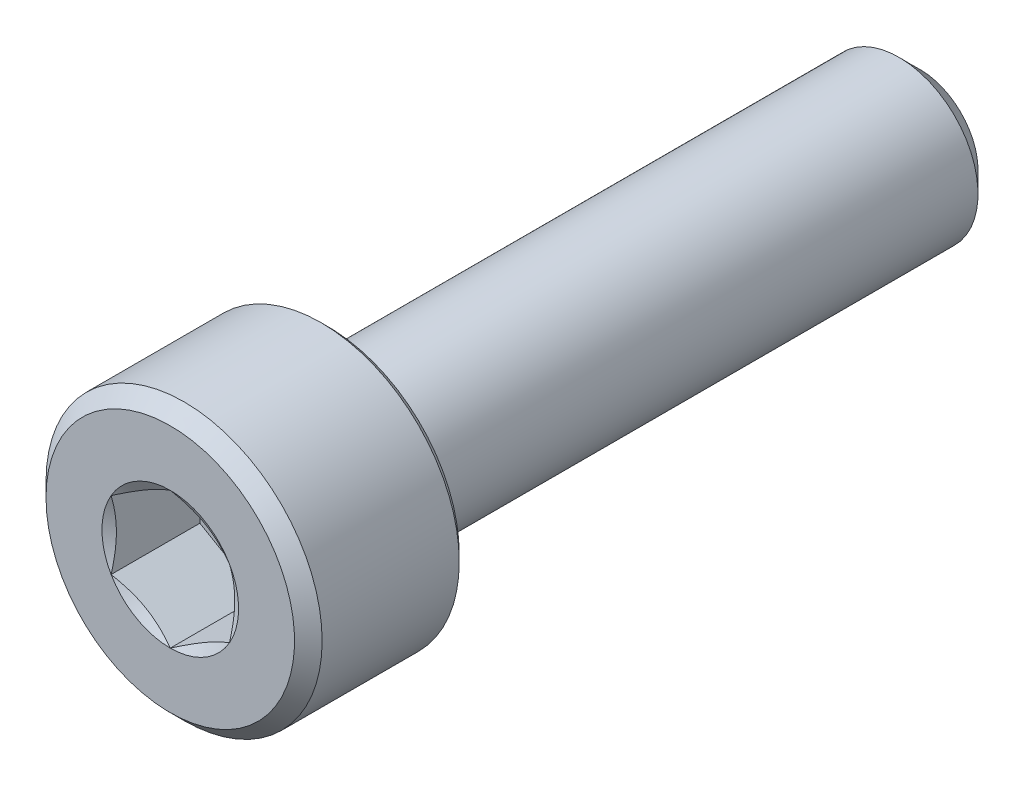
ISO-10303-21;
HEADER;
FILE_DESCRIPTION(('STEP AP214'),'2;1');
FILE_NAME('part.step','',(''),(''),'','','');
FILE_SCHEMA(('AUTOMOTIVE_DESIGN { 1 0 10303 214 1 1 1 1 }'));
ENDSEC;
DATA;
#1=APPLICATION_CONTEXT('core data for automotive mechanical design processes');
#2=APPLICATION_PROTOCOL_DEFINITION('international standard','automotive_design',2000,#1);
#3=PRODUCT_CONTEXT('',#1,'mechanical');
#4=PRODUCT('Part','Part','',(#3));
#5=PRODUCT_RELATED_PRODUCT_CATEGORY('part','',(#4));
#6=PRODUCT_DEFINITION_FORMATION('','',#4);
#7=PRODUCT_DEFINITION_CONTEXT('part definition',#1,'design');
#8=PRODUCT_DEFINITION('design','',#6,#7);
#9=PRODUCT_DEFINITION_SHAPE('','',#8);
#10=(LENGTH_UNIT() NAMED_UNIT(*) SI_UNIT(.MILLI.,.METRE.));
#11=(NAMED_UNIT(*) PLANE_ANGLE_UNIT() SI_UNIT($,.RADIAN.));
#12=(NAMED_UNIT(*) SI_UNIT($,.STERADIAN.) SOLID_ANGLE_UNIT());
#13=UNCERTAINTY_MEASURE_WITH_UNIT(LENGTH_MEASURE(1.E-05),#10,'distance_accuracy_value','');
#14=(GEOMETRIC_REPRESENTATION_CONTEXT(3) GLOBAL_UNCERTAINTY_ASSIGNED_CONTEXT((#13)) GLOBAL_UNIT_ASSIGNED_CONTEXT((#10,
#11,#12)) REPRESENTATION_CONTEXT('',''));
#15=CARTESIAN_POINT('',(0.,0.,0.));
#16=DIRECTION('',(0.,0.,1.));
#17=DIRECTION('',(1.,0.,0.));
#18=AXIS2_PLACEMENT_3D('',#15,#16,#17);
#19=CARTESIAN_POINT('',(0.,3.5,9.5));
#20=DIRECTION('',(0.,0.,1.));
#21=DIRECTION('',(1.,0.,0.));
#22=AXIS2_PLACEMENT_3D('',#19,#20,#21);
#23=PLANE('',#22);
#24=CARTESIAN_POINT('',(0.,0.,9.5));
#25=DIRECTION('',(0.,0.,1.));
#26=DIRECTION('',(1.,0.,0.));
#27=AXIS2_PLACEMENT_3D('',#24,#25,#26);
#28=CIRCLE('',#27,3.15);
#29=CARTESIAN_POINT('',(-3.15,0.,9.5));
#30=VERTEX_POINT('',#29);
#31=EDGE_CURVE('E169',#30,#30,#28,.T.);
#32=ORIENTED_EDGE('',*,*,#31,.T.);
#33=EDGE_LOOP('',(#32));
#34=FACE_BOUND('',#33,.T.);
#35=CARTESIAN_POINT('',(0.,0.,9.5));
#36=DIRECTION('',(0.,0.,1.));
#37=DIRECTION('',(1.,0.,0.));
#38=AXIS2_PLACEMENT_3D('',#35,#36,#37);
#39=CIRCLE('',#38,1.73205080756888);
#40=CARTESIAN_POINT('',(1.5,0.866025403784432,9.5));
#41=VERTEX_POINT('',#40);
#42=CARTESIAN_POINT('',(0.,1.73205080756887,9.5));
#43=VERTEX_POINT('',#42);
#44=EDGE_CURVE('E87',#41,#43,#39,.T.);
#45=ORIENTED_EDGE('',*,*,#44,.F.);
#46=CARTESIAN_POINT('',(1.5,-0.866025403784442,9.5));
#47=VERTEX_POINT('',#46);
#48=EDGE_CURVE('E47',#47,#41,#39,.T.);
#49=ORIENTED_EDGE('',*,*,#48,.F.);
#50=CARTESIAN_POINT('',(0.,-1.73205080756888,9.5));
#51=VERTEX_POINT('',#50);
#52=EDGE_CURVE('E274',#51,#47,#39,.T.);
#53=ORIENTED_EDGE('',*,*,#52,.F.);
#54=CARTESIAN_POINT('',(-1.5,-0.866025403784439,9.5));
#55=VERTEX_POINT('',#54);
#56=EDGE_CURVE('E54',#55,#51,#39,.T.);
#57=ORIENTED_EDGE('',*,*,#56,.F.);
#58=CARTESIAN_POINT('',(-1.5,0.866025403784436,9.5));
#59=VERTEX_POINT('',#58);
#60=EDGE_CURVE('E127',#59,#55,#39,.T.);
#61=ORIENTED_EDGE('',*,*,#60,.F.);
#62=EDGE_CURVE('E96',#43,#59,#39,.T.);
#63=ORIENTED_EDGE('',*,*,#62,.F.);
#64=EDGE_LOOP('',(#45,#49,#53,#57,#61,#63));
#65=FACE_BOUND('',#64,.T.);
#66=ADVANCED_FACE('F33',(#34,#65),#23,.T.);
#67=CARTESIAN_POINT('',(0.,0.,-9.5));
#68=DIRECTION('',(0.,0.,-1.));
#69=DIRECTION('',(-1.,0.,0.));
#70=AXIS2_PLACEMENT_3D('',#67,#68,#69);
#71=CYLINDRICAL_SURFACE('',#70,3.5);
#72=CARTESIAN_POINT('',(0.,0.,5.675));
#73=DIRECTION('',(0.,0.,-1.));
#74=DIRECTION('',(-1.,0.,0.));
#75=AXIS2_PLACEMENT_3D('',#72,#73,#74);
#76=CIRCLE('',#75,3.5);
#77=CARTESIAN_POINT('',(-3.5,0.,5.675));
#78=VERTEX_POINT('',#77);
#79=EDGE_CURVE('E11',#78,#78,#76,.F.);
#80=ORIENTED_EDGE('',*,*,#79,.T.);
#81=EDGE_LOOP('',(#80));
#82=FACE_BOUND('',#81,.T.);
#83=CARTESIAN_POINT('',(0.,0.,9.15));
#84=DIRECTION('',(0.,0.,1.));
#85=DIRECTION('',(1.,0.,0.));
#86=AXIS2_PLACEMENT_3D('',#83,#84,#85);
#87=CIRCLE('',#86,3.5);
#88=CARTESIAN_POINT('',(-3.5,0.,9.15));
#89=VERTEX_POINT('',#88);
#90=EDGE_CURVE('E106',#89,#89,#87,.F.);
#91=ORIENTED_EDGE('',*,*,#90,.T.);
#92=EDGE_LOOP('',(#91));
#93=FACE_BOUND('',#92,.T.);
#94=ADVANCED_FACE('F186',(#82,#93),#71,.T.);
#95=CARTESIAN_POINT('',(0.,3.5,5.5));
#96=DIRECTION('',(0.,0.,-1.));
#97=DIRECTION('',(-1.,0.,0.));
#98=AXIS2_PLACEMENT_3D('',#95,#96,#97);
#99=PLANE('',#98);
#100=CARTESIAN_POINT('',(0.,0.,5.5));
#101=DIRECTION('',(0.,0.,-1.));
#102=DIRECTION('',(-1.,0.,0.));
#103=AXIS2_PLACEMENT_3D('',#100,#101,#102);
#104=CIRCLE('',#103,3.325);
#105=CARTESIAN_POINT('',(-3.325,0.,5.5));
#106=VERTEX_POINT('',#105);
#107=EDGE_CURVE('E41',#106,#106,#104,.T.);
#108=ORIENTED_EDGE('',*,*,#107,.T.);
#109=EDGE_LOOP('',(#108));
#110=FACE_BOUND('',#109,.T.);
#111=CARTESIAN_POINT('',(0.,0.,5.5));
#112=DIRECTION('',(0.,0.,-1.));
#113=DIRECTION('',(-1.,0.,0.));
#114=AXIS2_PLACEMENT_3D('',#111,#112,#113);
#115=CIRCLE('',#114,2.);
#116=CARTESIAN_POINT('',(-2.,0.,5.5));
#117=VERTEX_POINT('',#116);
#118=EDGE_CURVE('E107',#117,#117,#115,.T.);
#119=ORIENTED_EDGE('',*,*,#118,.F.);
#120=EDGE_LOOP('',(#119));
#121=FACE_BOUND('',#120,.T.);
#122=ADVANCED_FACE('F174',(#110,#121),#99,.T.);
#123=CARTESIAN_POINT('',(0.,0.,-9.5));
#124=DIRECTION('',(0.,0.,-1.));
#125=DIRECTION('',(-1.,0.,0.));
#126=AXIS2_PLACEMENT_3D('',#123,#124,#125);
#127=CYLINDRICAL_SURFACE('',#126,2.);
#128=ORIENTED_EDGE('',*,*,#118,.T.);
#129=EDGE_LOOP('',(#128));
#130=FACE_BOUND('',#129,.T.);
#131=CARTESIAN_POINT('',(0.,0.,-8.975));
#132=DIRECTION('',(0.,0.,-1.));
#133=DIRECTION('',(-1.,0.,0.));
#134=AXIS2_PLACEMENT_3D('',#131,#132,#133);
#135=CIRCLE('',#134,2.);
#136=CARTESIAN_POINT('',(-2.,0.,-8.975));
#137=VERTEX_POINT('',#136);
#138=EDGE_CURVE('E215',#137,#137,#135,.T.);
#139=ORIENTED_EDGE('',*,*,#138,.F.);
#140=EDGE_LOOP('',(#139));
#141=FACE_BOUND('',#140,.T.);
#142=ADVANCED_FACE('F197',(#130,#141),#127,.T.);
#143=CARTESIAN_POINT('',(0.,0.,-9.5));
#144=DIRECTION('',(0.,0.,1.));
#145=DIRECTION('',(1.,0.,0.));
#146=AXIS2_PLACEMENT_3D('',#143,#144,#145);
#147=CONICAL_SURFACE('',#146,1.475,0.785398163397445);
#148=ORIENTED_EDGE('',*,*,#138,.T.);
#149=EDGE_LOOP('',(#148));
#150=FACE_BOUND('',#149,.T.);
#151=CARTESIAN_POINT('',(0.,0.,-9.5));
#152=DIRECTION('',(0.,0.,-1.));
#153=DIRECTION('',(-1.,0.,0.));
#154=AXIS2_PLACEMENT_3D('',#151,#152,#153);
#155=CIRCLE('',#154,1.475);
#156=CARTESIAN_POINT('',(-1.475,0.,-9.5));
#157=VERTEX_POINT('',#156);
#158=EDGE_CURVE('E213',#157,#157,#155,.T.);
#159=ORIENTED_EDGE('',*,*,#158,.F.);
#160=EDGE_LOOP('',(#159));
#161=FACE_BOUND('',#160,.T.);
#162=ADVANCED_FACE('F200',(#150,#161),#147,.T.);
#163=CARTESIAN_POINT('',(0.,1.475,-9.5));
#164=DIRECTION('',(0.,0.,-1.));
#165=DIRECTION('',(-1.,0.,0.));
#166=AXIS2_PLACEMENT_3D('',#163,#164,#165);
#167=PLANE('',#166);
#168=ORIENTED_EDGE('',*,*,#158,.T.);
#169=EDGE_LOOP('',(#168));
#170=FACE_BOUND('',#169,.T.);
#171=ADVANCED_FACE('F203',(#170),#167,.T.);
#172=CARTESIAN_POINT('',(0.,0.,9.5));
#173=DIRECTION('',(0.,0.,1.));
#174=DIRECTION('',(1.,0.,0.));
#175=AXIS2_PLACEMENT_3D('',#172,#173,#174);
#176=CONICAL_SURFACE('',#175,1.73205080756888,1.0471975511966);
#177=ORIENTED_EDGE('',*,*,#62,.T.);
#178=CARTESIAN_POINT('',(0.000199999999999562,1.73216627762271,9.50006667333289));
#179=CARTESIAN_POINT('',(-0.065719291102548,1.69410775715987,9.47808285655362));
#180=CARTESIAN_POINT('',(-0.132207589122235,1.65572072040024,9.45808888946626));
#181=CARTESIAN_POINT('',(-0.26633566066507,1.5782818421891,9.42318810096894));
#182=CARTESIAN_POINT('',(-0.333977818646886,1.53922862406973,9.40829362810761));
#183=CARTESIAN_POINT('',(-0.468423777869843,1.4616062133209,9.38510668109468));
#184=CARTESIAN_POINT('',(-0.535206884927248,1.42304896848399,9.37665991149625));
#185=CARTESIAN_POINT('',(-0.669087568389881,1.34575291984754,9.36657357729629));
#186=CARTESIAN_POINT('',(-0.736184657704378,1.30701439726998,9.36492566314233));
#187=CARTESIAN_POINT('',(-0.861574731829196,1.23462040422031,9.36834162283754));
#188=CARTESIAN_POINT('',(-0.919886423219819,1.20095413349903,9.37256675900842));
#189=CARTESIAN_POINT('',(-1.03612987953878,1.13384094270174,9.38596177521711));
#190=CARTESIAN_POINT('',(-1.09406124196879,1.10039425500826,9.39513623740029));
#191=CARTESIAN_POINT('',(-1.21054465133915,1.03314252725215,9.41807318373943));
#192=CARTESIAN_POINT('',(-1.26908194454669,0.999346005261147,9.43193296194588));
#193=CARTESIAN_POINT('',(-1.38528312338636,0.932257223377913,9.4633897840211));
#194=CARTESIAN_POINT('',(-1.44294849940381,0.898964103011317,9.48097942967405));
#195=CARTESIAN_POINT('',(-1.5002,0.865909933730597,9.50006667333289));
#196=B_SPLINE_CURVE_WITH_KNOTS('',3,(#178,#179,#180,#181,#182,#183,#184,#185,#186,#187,#188,
#189,#190,#191,#192,#193,#194,#195),.UNSPECIFIED.,.F.,.F.,(4,2,2,2,2,2,2,2,4),(0.,
0.237777822177383,0.476127422841918,0.70857706723059,0.94074115925158,1.1429435283589,
1.34533342091875,1.55221450553907,1.75868901573748),.UNSPECIFIED.);
#197=EDGE_CURVE('E101',#43,#59,#196,.T.);
#198=ORIENTED_EDGE('',*,*,#197,.F.);
#199=EDGE_LOOP('',(#177,#198));
#200=FACE_BOUND('',#199,.T.);
#201=ADVANCED_FACE('F102',(#200),#176,.F.);
#202=ORIENTED_EDGE('',*,*,#60,.T.);
#203=CARTESIAN_POINT('',(-1.5,-2.2427176821506,10.0577529331092));
#204=CARTESIAN_POINT('',(-1.5,-2.17794242733975,10.0266762062247));
#205=CARTESIAN_POINT('',(-1.5,-2.11300950440189,9.99592234644598));
#206=CARTESIAN_POINT('',(-1.5,-1.98274395237042,9.93524331298812));
#207=CARTESIAN_POINT('',(-1.5,-1.91741125389285,9.90531828844426));
#208=CARTESIAN_POINT('',(-1.5,-1.78588718127382,9.84631270004604));
#209=CARTESIAN_POINT('',(-1.5,-1.71969300240868,9.81723835986491));
#210=CARTESIAN_POINT('',(-1.5,-1.58675026270828,9.76039408518718));
#211=CARTESIAN_POINT('',(-1.5,-1.52000173091133,9.73262408286713));
#212=CARTESIAN_POINT('',(-1.5,-1.38408099810923,9.6780255362827));
#213=CARTESIAN_POINT('',(-1.5,-1.3148910525837,9.65124057909095));
#214=CARTESIAN_POINT('',(-1.5,-1.17568930059672,9.59990657269514));
#215=CARTESIAN_POINT('',(-1.5,-1.10567739238789,9.57535780366529));
#216=CARTESIAN_POINT('',(-1.5,-0.894522630301174,9.5061010853741));
#217=CARTESIAN_POINT('',(-1.5,-0.751874326050676,9.46562025803529));
#218=CARTESIAN_POINT('',(-1.5,-0.535047700412376,9.4186644881928));
#219=CARTESIAN_POINT('',(-1.5,-0.462365640221034,9.40531287274074));
#220=CARTESIAN_POINT('',(-1.5,-0.316183910454651,9.38411342271811));
#221=CARTESIAN_POINT('',(-1.5,-0.24268429647256,9.37626521621669));
#222=CARTESIAN_POINT('',(-1.5,-0.0961589362171834,9.36679853725012));
#223=CARTESIAN_POINT('',(-1.5,-0.0231380637139715,9.36510654950964));
#224=CARTESIAN_POINT('',(-1.5,0.122783079260705,9.36789942546461));
#225=CARTESIAN_POINT('',(-1.5,0.195683341984628,9.37238467163215));
#226=CARTESIAN_POINT('',(-1.5,0.375553919110711,9.39067763368449));
#227=CARTESIAN_POINT('',(-1.5,0.482175667555592,9.40791349824572));
#228=CARTESIAN_POINT('',(-1.5,0.69334577748019,9.45235981978959));
#229=CARTESIAN_POINT('',(-1.5,0.797891479277423,9.47958229854932));
#230=CARTESIAN_POINT('',(-1.5,0.954251071806743,9.52608494460259));
#231=CARTESIAN_POINT('',(-1.5,1.00687320410971,9.54274753439724));
#232=CARTESIAN_POINT('',(-1.5,1.11156970650931,9.57761409896659));
#233=CARTESIAN_POINT('',(-1.5,1.16364439595333,9.59581711179802));
#234=CARTESIAN_POINT('',(-1.5,1.26731560306244,9.63350016115478));
#235=CARTESIAN_POINT('',(-1.5,1.31891220569288,9.65297996560075));
#236=CARTESIAN_POINT('',(-1.5,1.42169884730406,9.69300589284368));
#237=CARTESIAN_POINT('',(-1.5,1.47288881589894,9.71355219579932));
#238=CARTESIAN_POINT('',(-1.5,1.60355339461358,9.76731366571294));
#239=CARTESIAN_POINT('',(-1.5,1.68276673443783,9.80116315833163));
#240=CARTESIAN_POINT('',(-1.5,1.84047808903307,9.87049388602784));
#241=CARTESIAN_POINT('',(-1.5,1.91897604968659,9.90597524334602));
#242=CARTESIAN_POINT('',(-1.5,2.15363522546688,10.0142918612321));
#243=CARTESIAN_POINT('',(-1.5,2.30893552285259,10.0889885631172));
#244=CARTESIAN_POINT('',(-1.5,2.61820933626907,10.2415147337872));
#245=CARTESIAN_POINT('',(-1.5,2.77218098653007,10.3193479409249));
#246=CARTESIAN_POINT('',(-1.5,3.07906936046556,10.4770156973325));
#247=CARTESIAN_POINT('',(-1.5,3.23198621511175,10.5568499922121));
#248=CARTESIAN_POINT('',(-1.5,3.52269097334794,10.7102968391743));
#249=CARTESIAN_POINT('',(-1.5,3.66054454478384,10.7837854153096));
#250=CARTESIAN_POINT('',(-1.5,3.9358082537871,10.9315998938077));
#251=CARTESIAN_POINT('',(-1.5,4.07321837470044,11.0059258271578));
#252=CARTESIAN_POINT('',(-1.5,4.34734790019874,11.1550151854867));
#253=CARTESIAN_POINT('',(-1.5,4.48406817266048,11.2297770168385));
#254=CARTESIAN_POINT('',(-1.5,4.75723230229823,11.3797872699595));
#255=CARTESIAN_POINT('',(-1.5,4.89367617356529,11.4550356660596));
#256=CARTESIAN_POINT('',(-1.5,5.03002074017739,11.53046248652));
#257=B_SPLINE_CURVE_WITH_KNOTS('',3,(#203,#204,#205,#206,#207,#208,#209,#210,#211,#212,#213,
#214,#215,#216,#217,#218,#219,#220,#221,#222,#223,#224,#225,#226,#227,#228,#229,#230,#231,#232,
#233,#234,#235,#236,#237,#238,#239,#240,#241,#242,#243,#244,#245,#246,#247,#248,#249,#250,#251,
#252,#253,#254,#255,#256),.UNSPECIFIED.,.F.,.F.,(4,2,2,2,2,2,2,2,2,2,2,2,2,2,2,2,2,2,2,2,2,2,2,
2,2,2,4),(0.,0.215535511604382,0.431109556594979,0.647991281388105,0.864861716171054,
1.08740133691196,1.30996880162059,1.75384817545399,1.97537465297243,2.19688615786688,
2.41574360885128,2.63461461131069,2.95796757347078,3.28171106856828,3.44728442970752,
3.61275514813738,3.77819587231577,3.94366463516204,4.20206568130719,4.46048611553466,
4.97741233836109,5.49497404006552,6.01247027664335,6.48112210038185,6.94979132441904,
7.41726847476583,7.88472116090933),.UNSPECIFIED.);
#258=EDGE_CURVE('E95',#59,#55,#257,.F.);
#259=ORIENTED_EDGE('',*,*,#258,.F.);
#260=EDGE_LOOP('',(#202,#259));
#261=FACE_BOUND('',#260,.T.);
#262=ADVANCED_FACE('F210',(#261),#176,.F.);
#263=ORIENTED_EDGE('',*,*,#56,.T.);
#264=CARTESIAN_POINT('',(-1.5002,-0.865909933730604,9.50006667333289));
#265=CARTESIAN_POINT('',(-1.43428070889745,-0.90396845419345,9.47808285655362));
#266=CARTESIAN_POINT('',(-1.36779241087776,-0.942355490953076,9.45808888946626));
#267=CARTESIAN_POINT('',(-1.23366433933493,-1.01979436916422,9.42318810096894));
#268=CARTESIAN_POINT('',(-1.16602218135311,-1.05884758728359,9.40829362810761));
#269=CARTESIAN_POINT('',(-1.03157622213016,-1.13646999803242,9.38510668109468));
#270=CARTESIAN_POINT('',(-0.964793115072752,-1.17502724286933,9.37665991149625));
#271=CARTESIAN_POINT('',(-0.830912431610119,-1.25232329150577,9.36657357729629));
#272=CARTESIAN_POINT('',(-0.763815342295621,-1.29106181408334,9.36492566314233));
#273=CARTESIAN_POINT('',(-0.638425268170804,-1.36345580713301,9.36834162283754));
#274=CARTESIAN_POINT('',(-0.58011357678018,-1.39712207785429,9.37256675900842));
#275=CARTESIAN_POINT('',(-0.463870120461217,-1.46423526865157,9.38596177521711));
#276=CARTESIAN_POINT('',(-0.405938758031214,-1.49768195634506,9.39513623740029));
#277=CARTESIAN_POINT('',(-0.289455348660848,-1.56493368410116,9.41807318373943));
#278=CARTESIAN_POINT('',(-0.230918055453308,-1.59873020609217,9.43193296194588));
#279=CARTESIAN_POINT('',(-0.11471687661364,-1.6658189879754,9.4633897840211));
#280=CARTESIAN_POINT('',(-0.0570515005961892,-1.699112108342,9.48097942967405));
#281=CARTESIAN_POINT('',(0.000200000000000225,-1.73216627762272,9.50006667333289));
#282=B_SPLINE_CURVE_WITH_KNOTS('',3,(#264,#265,#266,#267,#268,#269,#270,#271,#272,#273,#274,
#275,#276,#277,#278,#279,#280,#281),.UNSPECIFIED.,.F.,.F.,(4,2,2,2,2,2,2,2,4),(0.,
0.237777822177383,0.476127422841918,0.70857706723059,0.94074115925158,1.1429435283589,
1.34533342091875,1.55221450553907,1.75868901573748),.UNSPECIFIED.);
#283=EDGE_CURVE('E137',#55,#51,#282,.T.);
#284=ORIENTED_EDGE('',*,*,#283,.F.);
#285=EDGE_LOOP('',(#263,#284));
#286=FACE_BOUND('',#285,.T.);
#287=ADVANCED_FACE('F277',(#286),#176,.F.);
#288=ORIENTED_EDGE('',*,*,#52,.T.);
#289=CARTESIAN_POINT('',(-0.000199999999999374,-1.73216627762272,9.50006667333289));
#290=CARTESIAN_POINT('',(0.0657192911025481,-1.69410775715987,9.47808285655362));
#291=CARTESIAN_POINT('',(0.132207589122235,-1.65572072040025,9.45808888946626));
#292=CARTESIAN_POINT('',(0.266335660665071,-1.57828184218911,9.42318810096894));
#293=CARTESIAN_POINT('',(0.333977818646886,-1.53922862406974,9.40829362810761));
#294=CARTESIAN_POINT('',(0.468423777869843,-1.46160621332091,9.38510668109468));
#295=CARTESIAN_POINT('',(0.535206884927248,-1.42304896848399,9.37665991149625));
#296=CARTESIAN_POINT('',(0.669087568389881,-1.34575291984755,9.36657357729629));
#297=CARTESIAN_POINT('',(0.736184657704379,-1.30701439726999,9.36492566314233));
#298=CARTESIAN_POINT('',(0.861574731829196,-1.23462040422031,9.36834162283754));
#299=CARTESIAN_POINT('',(0.919886423219819,-1.20095413349904,9.37256675900842));
#300=CARTESIAN_POINT('',(1.03612987953878,-1.13384094270175,9.38596177521711));
#301=CARTESIAN_POINT('',(1.09406124196879,-1.10039425500827,9.39513623740029));
#302=CARTESIAN_POINT('',(1.21054465133915,-1.03314252725216,9.41807318373943));
#303=CARTESIAN_POINT('',(1.26908194454669,-0.999346005261155,9.43193296194588));
#304=CARTESIAN_POINT('',(1.38528312338636,-0.932257223377921,9.4633897840211));
#305=CARTESIAN_POINT('',(1.44294849940381,-0.898964103011324,9.48097942967405));
#306=CARTESIAN_POINT('',(1.5002,-0.865909933730604,9.50006667333289));
#307=B_SPLINE_CURVE_WITH_KNOTS('',3,(#289,#290,#291,#292,#293,#294,#295,#296,#297,#298,#299,
#300,#301,#302,#303,#304,#305,#306),.UNSPECIFIED.,.F.,.F.,(4,2,2,2,2,2,2,2,4),(0.,
0.237777822177383,0.476127422841918,0.70857706723059,0.94074115925158,1.1429435283589,
1.34533342091875,1.55221450553907,1.75868901573748),.UNSPECIFIED.);
#308=EDGE_CURVE('E251',#51,#47,#307,.T.);
#309=ORIENTED_EDGE('',*,*,#308,.F.);
#310=EDGE_LOOP('',(#288,#309));
#311=FACE_BOUND('',#310,.T.);
#312=ADVANCED_FACE('F276',(#311),#176,.F.);
#313=ORIENTED_EDGE('',*,*,#48,.T.);
#314=CARTESIAN_POINT('',(1.5,-2.2427176821506,10.0577529331092));
#315=CARTESIAN_POINT('',(1.5,-2.17794242733974,10.0266762062247));
#316=CARTESIAN_POINT('',(1.5,-2.11300950440189,9.99592234644598));
#317=CARTESIAN_POINT('',(1.5,-1.98274395237042,9.93524331298812));
#318=CARTESIAN_POINT('',(1.5,-1.91741125389284,9.90531828844426));
#319=CARTESIAN_POINT('',(1.5,-1.78588718127382,9.84631270004604));
#320=CARTESIAN_POINT('',(1.5,-1.71969300240868,9.81723835986491));
#321=CARTESIAN_POINT('',(1.5,-1.58675026270828,9.76039408518718));
#322=CARTESIAN_POINT('',(1.5,-1.52000173091133,9.73262408286713));
#323=CARTESIAN_POINT('',(1.5,-1.38408099810923,9.6780255362827));
#324=CARTESIAN_POINT('',(1.5,-1.3148910525837,9.65124057909095));
#325=CARTESIAN_POINT('',(1.5,-1.17568930059672,9.59990657269514));
#326=CARTESIAN_POINT('',(1.5,-1.10567739238789,9.57535780366529));
#327=CARTESIAN_POINT('',(1.5,-0.894522630301173,9.5061010853741));
#328=CARTESIAN_POINT('',(1.5,-0.751874326050675,9.46562025803529));
#329=CARTESIAN_POINT('',(1.5,-0.535047700412375,9.4186644881928));
#330=CARTESIAN_POINT('',(1.5,-0.462365640221033,9.40531287274074));
#331=CARTESIAN_POINT('',(1.5,-0.316183910454651,9.38411342271811));
#332=CARTESIAN_POINT('',(1.5,-0.24268429647256,9.37626521621669));
#333=CARTESIAN_POINT('',(1.5,-0.0961589362171831,9.36679853725012));
#334=CARTESIAN_POINT('',(1.5,-0.0231380637139712,9.36510654950964));
#335=CARTESIAN_POINT('',(1.5,0.122783079260705,9.36789942546461));
#336=CARTESIAN_POINT('',(1.5,0.195683341984629,9.37238467163215));
#337=CARTESIAN_POINT('',(1.5,0.375553919110712,9.39067763368449));
#338=CARTESIAN_POINT('',(1.5,0.482175667555593,9.40791349824572));
#339=CARTESIAN_POINT('',(1.5,0.69334577748019,9.45235981978959));
#340=CARTESIAN_POINT('',(1.5,0.797891479277423,9.47958229854932));
#341=CARTESIAN_POINT('',(1.5,0.954251071806743,9.52608494460259));
#342=CARTESIAN_POINT('',(1.5,1.00687320410971,9.54274753439724));
#343=CARTESIAN_POINT('',(1.5,1.11156970650931,9.57761409896659));
#344=CARTESIAN_POINT('',(1.5,1.16364439595333,9.59581711179802));
#345=CARTESIAN_POINT('',(1.5,1.26731560306244,9.63350016115478));
#346=CARTESIAN_POINT('',(1.5,1.31891220569288,9.65297996560074));
#347=CARTESIAN_POINT('',(1.5,1.42169884730406,9.69300589284368));
#348=CARTESIAN_POINT('',(1.5,1.47288881589894,9.71355219579932));
#349=CARTESIAN_POINT('',(1.5,1.60355339461358,9.76731366571294));
#350=CARTESIAN_POINT('',(1.5,1.68276673443783,9.80116315833164));
#351=CARTESIAN_POINT('',(1.5,1.84047808903307,9.87049388602784));
#352=CARTESIAN_POINT('',(1.5,1.91897604968659,9.90597524334602));
#353=CARTESIAN_POINT('',(1.5,2.15363522546688,10.0142918612321));
#354=CARTESIAN_POINT('',(1.5,2.3089355228526,10.0889885631172));
#355=CARTESIAN_POINT('',(1.5,2.61820933626907,10.2415147337872));
#356=CARTESIAN_POINT('',(1.5,2.77218098653007,10.3193479409249));
#357=CARTESIAN_POINT('',(1.5,3.07906936046557,10.4770156973325));
#358=CARTESIAN_POINT('',(1.5,3.23198621511176,10.5568499922121));
#359=CARTESIAN_POINT('',(1.5,3.52269097334794,10.7102968391743));
#360=CARTESIAN_POINT('',(1.5,3.66054454478384,10.7837854153096));
#361=CARTESIAN_POINT('',(1.5,3.9358082537871,10.9315998938077));
#362=CARTESIAN_POINT('',(1.5,4.07321837470044,11.0059258271578));
#363=CARTESIAN_POINT('',(1.5,4.34734790019874,11.1550151854867));
#364=CARTESIAN_POINT('',(1.5,4.48406817266048,11.2297770168385));
#365=CARTESIAN_POINT('',(1.5,4.75723230229823,11.3797872699595));
#366=CARTESIAN_POINT('',(1.5,4.89367617356529,11.4550356660596));
#367=CARTESIAN_POINT('',(1.5,5.03002074017739,11.53046248652));
#368=B_SPLINE_CURVE_WITH_KNOTS('',3,(#314,#315,#316,#317,#318,#319,#320,#321,#322,#323,#324,
#325,#326,#327,#328,#329,#330,#331,#332,#333,#334,#335,#336,#337,#338,#339,#340,#341,#342,#343,
#344,#345,#346,#347,#348,#349,#350,#351,#352,#353,#354,#355,#356,#357,#358,#359,#360,#361,#362,
#363,#364,#365,#366,#367),.UNSPECIFIED.,.F.,.F.,(4,2,2,2,2,2,2,2,2,2,2,2,2,2,2,2,2,2,2,2,2,2,2,
2,2,2,4),(0.,0.215535511604383,0.431109556594979,0.647991281388104,0.864861716171054,
1.08740133691196,1.30996880162059,1.75384817545399,1.97537465297243,2.19688615786688,
2.41574360885128,2.63461461131068,2.95796757347078,3.28171106856828,3.44728442970752,
3.61275514813737,3.77819587231577,3.94366463516204,4.20206568130719,4.46048611553466,
4.97741233836109,5.49497404006552,6.01247027664335,6.48112210038185,6.94979132441904,
7.41726847476583,7.88472116090933),.UNSPECIFIED.);
#369=EDGE_CURVE('E117',#47,#41,#368,.T.);
#370=ORIENTED_EDGE('',*,*,#369,.F.);
#371=EDGE_LOOP('',(#313,#370));
#372=FACE_BOUND('',#371,.T.);
#373=ADVANCED_FACE('F287',(#372),#176,.F.);
#374=ORIENTED_EDGE('',*,*,#44,.T.);
#375=CARTESIAN_POINT('',(1.5002,0.865909933730598,9.50006667333289));
#376=CARTESIAN_POINT('',(1.43428070889745,0.903968454193443,9.47808285655362));
#377=CARTESIAN_POINT('',(1.36779241087777,0.942355490953069,9.45808888946626));
#378=CARTESIAN_POINT('',(1.23366433933493,1.01979436916421,9.42318810096894));
#379=CARTESIAN_POINT('',(1.16602218135311,1.05884758728358,9.40829362810761));
#380=CARTESIAN_POINT('',(1.03157622213016,1.13646999803241,9.38510668109468));
#381=CARTESIAN_POINT('',(0.964793115072753,1.17502724286932,9.37665991149625));
#382=CARTESIAN_POINT('',(0.83091243161012,1.25232329150576,9.36657357729629));
#383=CARTESIAN_POINT('',(0.763815342295622,1.29106181408333,9.36492566314233));
#384=CARTESIAN_POINT('',(0.638425268170804,1.363455807133,9.36834162283754));
#385=CARTESIAN_POINT('',(0.58011357678018,1.39712207785428,9.37256675900842));
#386=CARTESIAN_POINT('',(0.463870120461217,1.46423526865157,9.38596177521711));
#387=CARTESIAN_POINT('',(0.405938758031214,1.49768195634505,9.39513623740029));
#388=CARTESIAN_POINT('',(0.289455348660847,1.56493368410116,9.41807318373943));
#389=CARTESIAN_POINT('',(0.230918055453308,1.59873020609216,9.43193296194588));
#390=CARTESIAN_POINT('',(0.11471687661364,1.6658189879754,9.4633897840211));
#391=CARTESIAN_POINT('',(0.057051500596189,1.69911210834199,9.48097942967405));
#392=CARTESIAN_POINT('',(-0.000200000000000511,1.73216627762271,9.50006667333289));
#393=B_SPLINE_CURVE_WITH_KNOTS('',3,(#375,#376,#377,#378,#379,#380,#381,#382,#383,#384,#385,
#386,#387,#388,#389,#390,#391,#392),.UNSPECIFIED.,.F.,.F.,(4,2,2,2,2,2,2,2,4),(0.,
0.237777822177383,0.476127422841918,0.708577067230589,0.94074115925158,1.1429435283589,
1.34533342091876,1.55221450553907,1.75868901573748),.UNSPECIFIED.);
#394=EDGE_CURVE('E91',#41,#43,#393,.T.);
#395=ORIENTED_EDGE('',*,*,#394,.F.);
#396=EDGE_LOOP('',(#374,#395));
#397=FACE_BOUND('',#396,.T.);
#398=ADVANCED_FACE('F89',(#397),#176,.F.);
#399=CARTESIAN_POINT('',(0.,0.,7.25));
#400=DIRECTION('',(0.,0.,1.));
#401=DIRECTION('',(1.,0.,0.));
#402=AXIS2_PLACEMENT_3D('',#399,#400,#401);
#403=PLANE('',#402);
#404=DIRECTION('',(-0.866025403784439,0.5,0.));
#405=VECTOR('',#404,1.);
#406=CARTESIAN_POINT('',(1.5,0.866025403784435,7.25));
#407=LINE('',#406,#405);
#408=CARTESIAN_POINT('',(1.5,0.866025403784435,7.25));
#409=VERTEX_POINT('',#408);
#410=CARTESIAN_POINT('',(0.,1.73205080756887,7.25));
#411=VERTEX_POINT('',#410);
#412=EDGE_CURVE('E116',#409,#411,#407,.T.);
#413=ORIENTED_EDGE('',*,*,#412,.T.);
#414=DIRECTION('',(-0.866025403784438,-0.5,0.));
#415=VECTOR('',#414,1.);
#416=CARTESIAN_POINT('',(0.,1.73205080756887,7.25));
#417=LINE('',#416,#415);
#418=CARTESIAN_POINT('',(-1.5,0.866025403784435,7.25));
#419=VERTEX_POINT('',#418);
#420=EDGE_CURVE('E121',#411,#419,#417,.T.);
#421=ORIENTED_EDGE('',*,*,#420,.T.);
#422=DIRECTION('',(0.,-1.,0.));
#423=VECTOR('',#422,1.);
#424=CARTESIAN_POINT('',(-1.5,0.866025403784435,7.25));
#425=LINE('',#424,#423);
#426=CARTESIAN_POINT('',(-1.5,-0.866025403784442,7.25));
#427=VERTEX_POINT('',#426);
#428=EDGE_CURVE('E237',#419,#427,#425,.T.);
#429=ORIENTED_EDGE('',*,*,#428,.T.);
#430=DIRECTION('',(0.866025403784439,-0.5,0.));
#431=VECTOR('',#430,1.);
#432=CARTESIAN_POINT('',(-1.5,-0.866025403784442,7.25));
#433=LINE('',#432,#431);
#434=CARTESIAN_POINT('',(0.,-1.73205080756888,7.25));
#435=VERTEX_POINT('',#434);
#436=EDGE_CURVE('E234',#427,#435,#433,.T.);
#437=ORIENTED_EDGE('',*,*,#436,.T.);
#438=DIRECTION('',(0.866025403784439,0.5,0.));
#439=VECTOR('',#438,1.);
#440=CARTESIAN_POINT('',(0.,-1.73205080756888,7.25));
#441=LINE('',#440,#439);
#442=CARTESIAN_POINT('',(1.5,-0.866025403784442,7.25));
#443=VERTEX_POINT('',#442);
#444=EDGE_CURVE('E231',#435,#443,#441,.T.);
#445=ORIENTED_EDGE('',*,*,#444,.T.);
#446=DIRECTION('',(0.,1.,0.));
#447=VECTOR('',#446,1.);
#448=CARTESIAN_POINT('',(1.5,-0.866025403784442,7.25));
#449=LINE('',#448,#447);
#450=EDGE_CURVE('E124',#443,#409,#449,.T.);
#451=ORIENTED_EDGE('',*,*,#450,.T.);
#452=EDGE_LOOP('',(#413,#421,#429,#437,#445,#451));
#453=FACE_BOUND('',#452,.T.);
#454=ADVANCED_FACE('F157',(#453),#403,.T.);
#455=CARTESIAN_POINT('',(0.,1.73205080756887,7.25));
#456=DIRECTION('',(-0.5,0.866025403784438,0.));
#457=DIRECTION('',(-0.866025403784439,-0.5,0.));
#458=AXIS2_PLACEMENT_3D('',#455,#456,#457);
#459=PLANE('',#458);
#460=DIRECTION('',(0.,0.,1.));
#461=VECTOR('',#460,1.);
#462=CARTESIAN_POINT('',(0.,1.73205080756887,7.25));
#463=LINE('',#462,#461);
#464=EDGE_CURVE('E113',#411,#43,#463,.T.);
#465=ORIENTED_EDGE('',*,*,#464,.T.);
#466=ORIENTED_EDGE('',*,*,#197,.T.);
#467=DIRECTION('',(0.,0.,1.));
#468=VECTOR('',#467,1.);
#469=CARTESIAN_POINT('',(-1.5,0.866025403784435,7.25));
#470=LINE('',#469,#468);
#471=EDGE_CURVE('E123',#419,#59,#470,.T.);
#472=ORIENTED_EDGE('',*,*,#471,.F.);
#473=ORIENTED_EDGE('',*,*,#420,.F.);
#474=EDGE_LOOP('',(#465,#466,#472,#473));
#475=FACE_BOUND('',#474,.T.);
#476=ADVANCED_FACE('F119',(#475),#459,.F.);
#477=CARTESIAN_POINT('',(-1.5,0.866025403784435,7.25));
#478=DIRECTION('',(-1.,0.,0.));
#479=DIRECTION('',(0.,-1.,0.));
#480=AXIS2_PLACEMENT_3D('',#477,#478,#479);
#481=PLANE('',#480);
#482=ORIENTED_EDGE('',*,*,#471,.T.);
#483=ORIENTED_EDGE('',*,*,#258,.T.);
#484=DIRECTION('',(0.,0.,1.));
#485=VECTOR('',#484,1.);
#486=CARTESIAN_POINT('',(-1.5,-0.866025403784442,7.25));
#487=LINE('',#486,#485);
#488=EDGE_CURVE('E222',#427,#55,#487,.T.);
#489=ORIENTED_EDGE('',*,*,#488,.F.);
#490=ORIENTED_EDGE('',*,*,#428,.F.);
#491=EDGE_LOOP('',(#482,#483,#489,#490));
#492=FACE_BOUND('',#491,.T.);
#493=ADVANCED_FACE('F146',(#492),#481,.F.);
#494=CARTESIAN_POINT('',(-1.5,-0.866025403784442,7.25));
#495=DIRECTION('',(-0.5,-0.866025403784439,0.));
#496=DIRECTION('',(0.866025403784439,-0.5,0.));
#497=AXIS2_PLACEMENT_3D('',#494,#495,#496);
#498=PLANE('',#497);
#499=ORIENTED_EDGE('',*,*,#488,.T.);
#500=ORIENTED_EDGE('',*,*,#283,.T.);
#501=DIRECTION('',(0.,0.,1.));
#502=VECTOR('',#501,1.);
#503=CARTESIAN_POINT('',(0.,-1.73205080756888,7.25));
#504=LINE('',#503,#502);
#505=EDGE_CURVE('E225',#435,#51,#504,.T.);
#506=ORIENTED_EDGE('',*,*,#505,.F.);
#507=ORIENTED_EDGE('',*,*,#436,.F.);
#508=EDGE_LOOP('',(#499,#500,#506,#507));
#509=FACE_BOUND('',#508,.T.);
#510=ADVANCED_FACE('F150',(#509),#498,.F.);
#511=CARTESIAN_POINT('',(0.,-1.73205080756888,7.25));
#512=DIRECTION('',(0.5,-0.866025403784439,0.));
#513=DIRECTION('',(0.866025403784439,0.5,0.));
#514=AXIS2_PLACEMENT_3D('',#511,#512,#513);
#515=PLANE('',#514);
#516=ORIENTED_EDGE('',*,*,#505,.T.);
#517=ORIENTED_EDGE('',*,*,#308,.T.);
#518=DIRECTION('',(0.,0.,1.));
#519=VECTOR('',#518,1.);
#520=CARTESIAN_POINT('',(1.5,-0.866025403784442,7.25));
#521=LINE('',#520,#519);
#522=EDGE_CURVE('E218',#443,#47,#521,.T.);
#523=ORIENTED_EDGE('',*,*,#522,.F.);
#524=ORIENTED_EDGE('',*,*,#444,.F.);
#525=EDGE_LOOP('',(#516,#517,#523,#524));
#526=FACE_BOUND('',#525,.T.);
#527=ADVANCED_FACE('F259',(#526),#515,.F.);
#528=CARTESIAN_POINT('',(1.5,-0.866025403784442,7.25));
#529=DIRECTION('',(1.,0.,0.));
#530=DIRECTION('',(0.,0.,-1.));
#531=AXIS2_PLACEMENT_3D('',#528,#529,#530);
#532=PLANE('',#531);
#533=ORIENTED_EDGE('',*,*,#522,.T.);
#534=ORIENTED_EDGE('',*,*,#369,.T.);
#535=DIRECTION('',(0.,0.,1.));
#536=VECTOR('',#535,1.);
#537=CARTESIAN_POINT('',(1.5,0.866025403784435,7.25));
#538=LINE('',#537,#536);
#539=EDGE_CURVE('E115',#409,#41,#538,.T.);
#540=ORIENTED_EDGE('',*,*,#539,.F.);
#541=ORIENTED_EDGE('',*,*,#450,.F.);
#542=EDGE_LOOP('',(#533,#534,#540,#541));
#543=FACE_BOUND('',#542,.T.);
#544=ADVANCED_FACE('F256',(#543),#532,.F.);
#545=CARTESIAN_POINT('',(1.5,0.866025403784435,7.25));
#546=DIRECTION('',(0.5,0.866025403784439,0.));
#547=DIRECTION('',(-0.866025403784439,0.5,0.));
#548=AXIS2_PLACEMENT_3D('',#545,#546,#547);
#549=PLANE('',#548);
#550=ORIENTED_EDGE('',*,*,#539,.T.);
#551=ORIENTED_EDGE('',*,*,#394,.T.);
#552=ORIENTED_EDGE('',*,*,#464,.F.);
#553=ORIENTED_EDGE('',*,*,#412,.F.);
#554=EDGE_LOOP('',(#550,#551,#552,#553));
#555=FACE_BOUND('',#554,.T.);
#556=ADVANCED_FACE('F111',(#555),#549,.F.);
#557=CARTESIAN_POINT('',(0.,0.,9.15));
#558=DIRECTION('',(0.,0.,-1.));
#559=DIRECTION('',(-1.,0.,0.));
#560=AXIS2_PLACEMENT_3D('',#557,#558,#559);
#561=CONICAL_SURFACE('',#560,3.5,0.785398163397453);
#562=CARTESIAN_POINT('',(-3.15,0.,9.5));
#563=CARTESIAN_POINT('',(-3.15364583333333,0.,9.49635416666667));
#564=CARTESIAN_POINT('',(-3.15729166666666,0.,9.49270833333333));
#565=CARTESIAN_POINT('',(-3.16458333333333,0.,9.48541666666667));
#566=CARTESIAN_POINT('',(-3.16822916666666,0.,9.48177083333333));
#567=CARTESIAN_POINT('',(-3.17552083333333,0.,9.47447916666667));
#568=CARTESIAN_POINT('',(-3.17916666666666,0.,9.47083333333333));
#569=CARTESIAN_POINT('',(-3.18645833333333,0.,9.46354166666667));
#570=CARTESIAN_POINT('',(-3.19010416666666,0.,9.45989583333333));
#571=CARTESIAN_POINT('',(-3.19739583333333,0.,9.45260416666667));
#572=CARTESIAN_POINT('',(-3.20104166666666,0.,9.44895833333333));
#573=CARTESIAN_POINT('',(-3.20833333333333,0.,9.44166666666667));
#574=CARTESIAN_POINT('',(-3.21197916666666,0.,9.43802083333333));
#575=CARTESIAN_POINT('',(-3.21927083333333,0.,9.43072916666667));
#576=CARTESIAN_POINT('',(-3.22291666666666,0.,9.42708333333333));
#577=CARTESIAN_POINT('',(-3.23020833333333,0.,9.41979166666667));
#578=CARTESIAN_POINT('',(-3.23385416666666,0.,9.41614583333333));
#579=CARTESIAN_POINT('',(-3.24114583333333,0.,9.40885416666667));
#580=CARTESIAN_POINT('',(-3.24479166666666,0.,9.40520833333333));
#581=CARTESIAN_POINT('',(-3.25208333333333,0.,9.39791666666667));
#582=CARTESIAN_POINT('',(-3.25572916666667,0.,9.39427083333333));
#583=CARTESIAN_POINT('',(-3.26302083333333,0.,9.38697916666667));
#584=CARTESIAN_POINT('',(-3.26666666666667,0.,9.38333333333333));
#585=CARTESIAN_POINT('',(-3.27395833333333,0.,9.37604166666667));
#586=CARTESIAN_POINT('',(-3.27760416666667,0.,9.37239583333333));
#587=CARTESIAN_POINT('',(-3.28489583333333,0.,9.36510416666667));
#588=CARTESIAN_POINT('',(-3.28854166666666,0.,9.36145833333333));
#589=CARTESIAN_POINT('',(-3.29583333333333,0.,9.35416666666667));
#590=CARTESIAN_POINT('',(-3.29947916666667,0.,9.35052083333333));
#591=CARTESIAN_POINT('',(-3.30677083333333,0.,9.34322916666667));
#592=CARTESIAN_POINT('',(-3.31041666666667,0.,9.33958333333333));
#593=CARTESIAN_POINT('',(-3.31770833333333,0.,9.33229166666667));
#594=CARTESIAN_POINT('',(-3.32135416666667,0.,9.32864583333333));
#595=CARTESIAN_POINT('',(-3.32864583333333,0.,9.32135416666667));
#596=CARTESIAN_POINT('',(-3.33229166666667,0.,9.31770833333333));
#597=CARTESIAN_POINT('',(-3.33958333333333,0.,9.31041666666667));
#598=CARTESIAN_POINT('',(-3.34322916666667,0.,9.30677083333333));
#599=CARTESIAN_POINT('',(-3.35052083333333,0.,9.29947916666667));
#600=CARTESIAN_POINT('',(-3.35416666666667,0.,9.29583333333333));
#601=CARTESIAN_POINT('',(-3.36145833333333,0.,9.28854166666667));
#602=CARTESIAN_POINT('',(-3.36510416666667,0.,9.28489583333333));
#603=CARTESIAN_POINT('',(-3.37239583333333,0.,9.27760416666667));
#604=CARTESIAN_POINT('',(-3.37604166666667,0.,9.27395833333333));
#605=CARTESIAN_POINT('',(-3.38333333333333,0.,9.26666666666667));
#606=CARTESIAN_POINT('',(-3.38697916666667,0.,9.26302083333333));
#607=CARTESIAN_POINT('',(-3.39427083333333,0.,9.25572916666667));
#608=CARTESIAN_POINT('',(-3.39791666666667,0.,9.25208333333333));
#609=CARTESIAN_POINT('',(-3.40520833333333,0.,9.24479166666667));
#610=CARTESIAN_POINT('',(-3.40885416666667,0.,9.24114583333333));
#611=CARTESIAN_POINT('',(-3.41614583333333,0.,9.23385416666667));
#612=CARTESIAN_POINT('',(-3.41979166666667,0.,9.23020833333333));
#613=CARTESIAN_POINT('',(-3.42708333333333,0.,9.22291666666667));
#614=CARTESIAN_POINT('',(-3.43072916666667,0.,9.21927083333333));
#615=CARTESIAN_POINT('',(-3.43802083333333,0.,9.21197916666667));
#616=CARTESIAN_POINT('',(-3.44166666666667,0.,9.20833333333333));
#617=CARTESIAN_POINT('',(-3.44895833333333,0.,9.20104166666667));
#618=CARTESIAN_POINT('',(-3.45260416666667,0.,9.19739583333333));
#619=CARTESIAN_POINT('',(-3.45989583333333,0.,9.19010416666667));
#620=CARTESIAN_POINT('',(-3.46354166666667,0.,9.18645833333333));
#621=CARTESIAN_POINT('',(-3.47083333333333,0.,9.17916666666667));
#622=CARTESIAN_POINT('',(-3.47447916666667,0.,9.17552083333333));
#623=CARTESIAN_POINT('',(-3.48177083333333,0.,9.16822916666667));
#624=CARTESIAN_POINT('',(-3.48541666666667,0.,9.16458333333333));
#625=CARTESIAN_POINT('',(-3.49270833333333,0.,9.15729166666667));
#626=CARTESIAN_POINT('',(-3.49635416666667,0.,9.15364583333333));
#627=CARTESIAN_POINT('',(-3.5,0.,9.15));
#628=B_SPLINE_CURVE_WITH_KNOTS('',3,(#562,#563,#564,#565,#566,#567,#568,#569,#570,#571,#572,
#573,#574,#575,#576,#577,#578,#579,#580,#581,#582,#583,#584,#585,#586,#587,#588,#589,#590,#591,
#592,#593,#594,#595,#596,#597,#598,#599,#600,#601,#602,#603,#604,#605,#606,#607,#608,#609,#610,
#611,#612,#613,#614,#615,#616,#617,#618,#619,#620,#621,#622,#623,#624,#625,#626,#627),
.UNSPECIFIED.,.F.,.F.,(4,2,2,2,2,2,2,2,2,2,2,2,2,2,2,2,2,2,2,2,2,2,2,2,2,2,2,2,2,2,2,2,4),(0.,
0.0154679608384562,0.0309359216769123,0.0464038825153685,0.0618718433538235,0.0773398041922796,
0.0928077650307358,0.10827572586919,0.123743686707647,0.139211647546103,0.154679608384558,
0.170147569223014,0.18561553006147,0.201083490899925,0.216551451738381,0.232019412576837,
0.247487373415292,0.262955334253749,0.278423295092205,0.293891255930661,0.309359216769116,
0.324827177607572,0.340295138446028,0.355763099284483,0.371231060122939,0.386699020961395,
0.40216698179985,0.417634942638307,0.433102903476763,0.448570864315218,0.464038825153674,
0.47950678599213,0.494974746830585),.UNSPECIFIED.);
#629=EDGE_CURVE('BSEAM178',#30,#89,#628,.T.);
#630=ORIENTED_EDGE('',*,*,#31,.F.);
#631=ORIENTED_EDGE('',*,*,#90,.F.);
#632=ORIENTED_EDGE('',*,*,#629,.T.);
#633=ORIENTED_EDGE('',*,*,#629,.F.);
#634=EDGE_LOOP('',(#630,#632,#631,#633));
#635=FACE_BOUND('',#634,.T.);
#636=ADVANCED_FACE('F178',(#635),#561,.T.);
#637=CARTESIAN_POINT('',(0.,0.,5.5));
#638=DIRECTION('',(0.,0.,1.));
#639=DIRECTION('',(1.,0.,0.));
#640=AXIS2_PLACEMENT_3D('',#637,#638,#639);
#641=CONICAL_SURFACE('',#640,3.325,0.785398163397452);
#642=ORIENTED_EDGE('',*,*,#79,.F.);
#643=EDGE_LOOP('',(#642));
#644=FACE_BOUND('',#643,.T.);
#645=ORIENTED_EDGE('',*,*,#107,.F.);
#646=EDGE_LOOP('',(#645));
#647=FACE_BOUND('',#646,.T.);
#648=ADVANCED_FACE('F35',(#644,#647),#641,.T.);
#649=CLOSED_SHELL('',(#66,#94,#122,#142,#162,#171,#201,#262,#287,#312,#373,#398,#454,#476,#493,
#510,#527,#544,#556,#636,#648));
#650=MANIFOLD_SOLID_BREP('B2',#649);
#651=ADVANCED_BREP_SHAPE_REPRESENTATION('',(#18,#650),#14);
#652=SHAPE_DEFINITION_REPRESENTATION(#9,#651);
ENDSEC;
END-ISO-10303-21;
